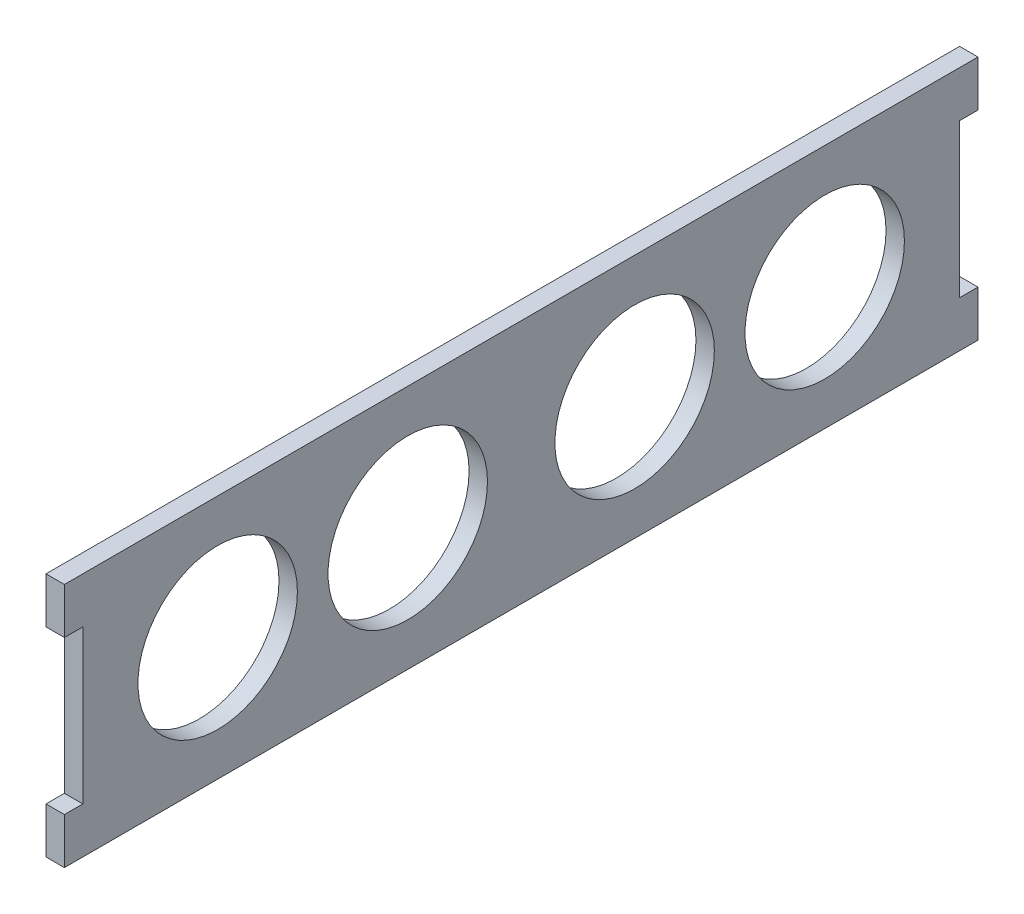
ISO-10303-21;
HEADER;
FILE_DESCRIPTION(('STEP AP214'),'2;1');
FILE_NAME('part.step','',(''),(''),'','','');
FILE_SCHEMA(('AUTOMOTIVE_DESIGN { 1 0 10303 214 1 1 1 1 }'));
ENDSEC;
DATA;
#1=APPLICATION_CONTEXT('core data for automotive mechanical design processes');
#2=APPLICATION_PROTOCOL_DEFINITION('international standard','automotive_design',2000,#1);
#3=PRODUCT_CONTEXT('',#1,'mechanical');
#4=PRODUCT('Part','Part','',(#3));
#5=PRODUCT_RELATED_PRODUCT_CATEGORY('part','',(#4));
#6=PRODUCT_DEFINITION_FORMATION('','',#4);
#7=PRODUCT_DEFINITION_CONTEXT('part definition',#1,'design');
#8=PRODUCT_DEFINITION('design','',#6,#7);
#9=PRODUCT_DEFINITION_SHAPE('','',#8);
#10=(LENGTH_UNIT() NAMED_UNIT(*) SI_UNIT(.MILLI.,.METRE.));
#11=(NAMED_UNIT(*) PLANE_ANGLE_UNIT() SI_UNIT($,.RADIAN.));
#12=(NAMED_UNIT(*) SI_UNIT($,.STERADIAN.) SOLID_ANGLE_UNIT());
#13=UNCERTAINTY_MEASURE_WITH_UNIT(LENGTH_MEASURE(1.E-05),#10,'distance_accuracy_value','');
#14=(GEOMETRIC_REPRESENTATION_CONTEXT(3) GLOBAL_UNCERTAINTY_ASSIGNED_CONTEXT((#13)) GLOBAL_UNIT_ASSIGNED_CONTEXT((#10,
#11,#12)) REPRESENTATION_CONTEXT('',''));
#15=CARTESIAN_POINT('',(0.,0.,0.));
#16=DIRECTION('',(0.,0.,1.));
#17=DIRECTION('',(1.,0.,0.));
#18=AXIS2_PLACEMENT_3D('',#15,#16,#17);
#19=CARTESIAN_POINT('',(3.,0.,71.5));
#20=DIRECTION('',(0.,0.,-1.));
#21=DIRECTION('',(-1.,0.,0.));
#22=AXIS2_PLACEMENT_3D('',#19,#20,#21);
#23=PLANE('',#22);
#24=DIRECTION('',(0.,-1.,0.));
#25=VECTOR('',#24,1.);
#26=CARTESIAN_POINT('',(0.,0.,71.5));
#27=LINE('',#26,#25);
#28=CARTESIAN_POINT('',(0.,12.5,71.5));
#29=VERTEX_POINT('',#28);
#30=CARTESIAN_POINT('',(0.,-12.5,71.5));
#31=VERTEX_POINT('',#30);
#32=EDGE_CURVE('E170',#29,#31,#27,.T.);
#33=ORIENTED_EDGE('',*,*,#32,.T.);
#34=DIRECTION('',(-1.,0.,0.));
#35=VECTOR('',#34,1.);
#36=CARTESIAN_POINT('',(3.,-12.5,71.5));
#37=LINE('',#36,#35);
#38=CARTESIAN_POINT('',(3.,-12.5,71.5));
#39=VERTEX_POINT('',#38);
#40=EDGE_CURVE('E11',#39,#31,#37,.T.);
#41=ORIENTED_EDGE('',*,*,#40,.F.);
#42=DIRECTION('',(0.,-1.,0.));
#43=VECTOR('',#42,1.);
#44=CARTESIAN_POINT('',(3.,0.,71.5));
#45=LINE('',#44,#43);
#46=CARTESIAN_POINT('',(3.,12.5,71.5));
#47=VERTEX_POINT('',#46);
#48=EDGE_CURVE('E104',#47,#39,#45,.T.);
#49=ORIENTED_EDGE('',*,*,#48,.F.);
#50=DIRECTION('',(-1.,0.,0.));
#51=VECTOR('',#50,1.);
#52=CARTESIAN_POINT('',(3.,12.5,71.5));
#53=LINE('',#52,#51);
#54=EDGE_CURVE('E157',#47,#29,#53,.T.);
#55=ORIENTED_EDGE('',*,*,#54,.T.);
#56=EDGE_LOOP('',(#33,#41,#49,#55));
#57=FACE_BOUND('',#56,.T.);
#58=ADVANCED_FACE('F36',(#57),#23,.F.);
#59=CARTESIAN_POINT('',(3.,-12.5,0.));
#60=DIRECTION('',(0.,1.,0.));
#61=DIRECTION('',(0.,0.,1.));
#62=AXIS2_PLACEMENT_3D('',#59,#60,#61);
#63=PLANE('',#62);
#64=DIRECTION('',(0.,0.,-1.));
#65=VECTOR('',#64,1.);
#66=CARTESIAN_POINT('',(0.,-12.5,0.));
#67=LINE('',#66,#65);
#68=CARTESIAN_POINT('',(0.,-12.5,74.5));
#69=VERTEX_POINT('',#68);
#70=EDGE_CURVE('E173',#69,#31,#67,.T.);
#71=ORIENTED_EDGE('',*,*,#70,.F.);
#72=DIRECTION('',(-1.,0.,0.));
#73=VECTOR('',#72,1.);
#74=CARTESIAN_POINT('',(3.,-12.5,74.5));
#75=LINE('',#74,#73);
#76=CARTESIAN_POINT('',(3.,-12.5,74.5));
#77=VERTEX_POINT('',#76);
#78=EDGE_CURVE('E45',#77,#69,#75,.T.);
#79=ORIENTED_EDGE('',*,*,#78,.F.);
#80=DIRECTION('',(0.,0.,-1.));
#81=VECTOR('',#80,1.);
#82=CARTESIAN_POINT('',(3.,-12.5,0.));
#83=LINE('',#82,#81);
#84=EDGE_CURVE('E229',#77,#39,#83,.T.);
#85=ORIENTED_EDGE('',*,*,#84,.T.);
#86=ORIENTED_EDGE('',*,*,#40,.T.);
#87=EDGE_LOOP('',(#71,#79,#85,#86));
#88=FACE_BOUND('',#87,.T.);
#89=ADVANCED_FACE('F228',(#88),#63,.T.);
#90=CARTESIAN_POINT('',(3.,0.,74.5));
#91=DIRECTION('',(0.,0.,-1.));
#92=DIRECTION('',(-1.,0.,0.));
#93=AXIS2_PLACEMENT_3D('',#90,#91,#92);
#94=PLANE('',#93);
#95=DIRECTION('',(0.,-1.,0.));
#96=VECTOR('',#95,1.);
#97=CARTESIAN_POINT('',(0.,0.,74.5));
#98=LINE('',#97,#96);
#99=CARTESIAN_POINT('',(0.,-20.,74.5));
#100=VERTEX_POINT('',#99);
#101=EDGE_CURVE('E176',#69,#100,#98,.T.);
#102=ORIENTED_EDGE('',*,*,#101,.T.);
#103=DIRECTION('',(-1.,0.,0.));
#104=VECTOR('',#103,1.);
#105=CARTESIAN_POINT('',(3.,-20.,74.5));
#106=LINE('',#105,#104);
#107=CARTESIAN_POINT('',(3.,-20.,74.5));
#108=VERTEX_POINT('',#107);
#109=EDGE_CURVE('E213',#108,#100,#106,.T.);
#110=ORIENTED_EDGE('',*,*,#109,.F.);
#111=DIRECTION('',(0.,-1.,0.));
#112=VECTOR('',#111,1.);
#113=CARTESIAN_POINT('',(3.,0.,74.5));
#114=LINE('',#113,#112);
#115=EDGE_CURVE('E220',#77,#108,#114,.T.);
#116=ORIENTED_EDGE('',*,*,#115,.F.);
#117=ORIENTED_EDGE('',*,*,#78,.T.);
#118=EDGE_LOOP('',(#102,#110,#116,#117));
#119=FACE_BOUND('',#118,.T.);
#120=ADVANCED_FACE('F218',(#119),#94,.F.);
#121=CARTESIAN_POINT('',(3.,-20.,0.));
#122=DIRECTION('',(0.,1.,0.));
#123=DIRECTION('',(0.,0.,1.));
#124=AXIS2_PLACEMENT_3D('',#121,#122,#123);
#125=PLANE('',#124);
#126=DIRECTION('',(0.,0.,-1.));
#127=VECTOR('',#126,1.);
#128=CARTESIAN_POINT('',(0.,-20.,0.));
#129=LINE('',#128,#127);
#130=CARTESIAN_POINT('',(0.,-20.,-74.5));
#131=VERTEX_POINT('',#130);
#132=EDGE_CURVE('E178',#100,#131,#129,.T.);
#133=ORIENTED_EDGE('',*,*,#132,.T.);
#134=DIRECTION('',(-1.,0.,0.));
#135=VECTOR('',#134,1.);
#136=CARTESIAN_POINT('',(3.,-20.,-74.5));
#137=LINE('',#136,#135);
#138=CARTESIAN_POINT('',(3.,-20.,-74.5));
#139=VERTEX_POINT('',#138);
#140=EDGE_CURVE('E211',#139,#131,#137,.T.);
#141=ORIENTED_EDGE('',*,*,#140,.F.);
#142=DIRECTION('',(0.,0.,-1.));
#143=VECTOR('',#142,1.);
#144=CARTESIAN_POINT('',(3.,-20.,0.));
#145=LINE('',#144,#143);
#146=EDGE_CURVE('E257',#108,#139,#145,.T.);
#147=ORIENTED_EDGE('',*,*,#146,.F.);
#148=ORIENTED_EDGE('',*,*,#109,.T.);
#149=EDGE_LOOP('',(#133,#141,#147,#148));
#150=FACE_BOUND('',#149,.T.);
#151=ADVANCED_FACE('F256',(#150),#125,.F.);
#152=CARTESIAN_POINT('',(3.,0.,-74.5));
#153=DIRECTION('',(0.,0.,-1.));
#154=DIRECTION('',(-1.,0.,0.));
#155=AXIS2_PLACEMENT_3D('',#152,#153,#154);
#156=PLANE('',#155);
#157=DIRECTION('',(0.,-1.,0.));
#158=VECTOR('',#157,1.);
#159=CARTESIAN_POINT('',(0.,0.,-74.5));
#160=LINE('',#159,#158);
#161=CARTESIAN_POINT('',(0.,-12.5,-74.5));
#162=VERTEX_POINT('',#161);
#163=EDGE_CURVE('E181',#162,#131,#160,.T.);
#164=ORIENTED_EDGE('',*,*,#163,.F.);
#165=DIRECTION('',(-1.,0.,0.));
#166=VECTOR('',#165,1.);
#167=CARTESIAN_POINT('',(3.,-12.5,-74.5));
#168=LINE('',#167,#166);
#169=CARTESIAN_POINT('',(3.,-12.5,-74.5));
#170=VERTEX_POINT('',#169);
#171=EDGE_CURVE('E209',#170,#162,#168,.T.);
#172=ORIENTED_EDGE('',*,*,#171,.F.);
#173=DIRECTION('',(0.,-1.,0.));
#174=VECTOR('',#173,1.);
#175=CARTESIAN_POINT('',(3.,0.,-74.5));
#176=LINE('',#175,#174);
#177=EDGE_CURVE('E253',#170,#139,#176,.T.);
#178=ORIENTED_EDGE('',*,*,#177,.T.);
#179=ORIENTED_EDGE('',*,*,#140,.T.);
#180=EDGE_LOOP('',(#164,#172,#178,#179));
#181=FACE_BOUND('',#180,.T.);
#182=ADVANCED_FACE('F248',(#181),#156,.T.);
#183=CARTESIAN_POINT('',(3.,-12.5,0.));
#184=DIRECTION('',(0.,-1.,0.));
#185=DIRECTION('',(0.,0.,-1.));
#186=AXIS2_PLACEMENT_3D('',#183,#184,#185);
#187=PLANE('',#186);
#188=DIRECTION('',(0.,0.,1.));
#189=VECTOR('',#188,1.);
#190=CARTESIAN_POINT('',(0.,-12.5,0.));
#191=LINE('',#190,#189);
#192=CARTESIAN_POINT('',(0.,-12.5,-71.5));
#193=VERTEX_POINT('',#192);
#194=EDGE_CURVE('E184',#162,#193,#191,.T.);
#195=ORIENTED_EDGE('',*,*,#194,.T.);
#196=DIRECTION('',(-1.,0.,0.));
#197=VECTOR('',#196,1.);
#198=CARTESIAN_POINT('',(3.,-12.5,-71.5));
#199=LINE('',#198,#197);
#200=CARTESIAN_POINT('',(3.,-12.5,-71.5));
#201=VERTEX_POINT('',#200);
#202=EDGE_CURVE('E207',#201,#193,#199,.T.);
#203=ORIENTED_EDGE('',*,*,#202,.F.);
#204=DIRECTION('',(0.,0.,1.));
#205=VECTOR('',#204,1.);
#206=CARTESIAN_POINT('',(3.,-12.5,0.));
#207=LINE('',#206,#205);
#208=EDGE_CURVE('E259',#170,#201,#207,.T.);
#209=ORIENTED_EDGE('',*,*,#208,.F.);
#210=ORIENTED_EDGE('',*,*,#171,.T.);
#211=EDGE_LOOP('',(#195,#203,#209,#210));
#212=FACE_BOUND('',#211,.T.);
#213=ADVANCED_FACE('F266',(#212),#187,.F.);
#214=CARTESIAN_POINT('',(3.,0.,-71.5));
#215=DIRECTION('',(0.,0.,-1.));
#216=DIRECTION('',(-1.,0.,0.));
#217=AXIS2_PLACEMENT_3D('',#214,#215,#216);
#218=PLANE('',#217);
#219=DIRECTION('',(0.,-1.,0.));
#220=VECTOR('',#219,1.);
#221=CARTESIAN_POINT('',(0.,0.,-71.5));
#222=LINE('',#221,#220);
#223=CARTESIAN_POINT('',(0.,12.5,-71.5));
#224=VERTEX_POINT('',#223);
#225=EDGE_CURVE('E187',#224,#193,#222,.T.);
#226=ORIENTED_EDGE('',*,*,#225,.F.);
#227=DIRECTION('',(-1.,0.,0.));
#228=VECTOR('',#227,1.);
#229=CARTESIAN_POINT('',(3.,12.5,-71.5));
#230=LINE('',#229,#228);
#231=CARTESIAN_POINT('',(3.,12.5,-71.5));
#232=VERTEX_POINT('',#231);
#233=EDGE_CURVE('E205',#232,#224,#230,.T.);
#234=ORIENTED_EDGE('',*,*,#233,.F.);
#235=DIRECTION('',(0.,-1.,0.));
#236=VECTOR('',#235,1.);
#237=CARTESIAN_POINT('',(3.,0.,-71.5));
#238=LINE('',#237,#236);
#239=EDGE_CURVE('E265',#232,#201,#238,.T.);
#240=ORIENTED_EDGE('',*,*,#239,.T.);
#241=ORIENTED_EDGE('',*,*,#202,.T.);
#242=EDGE_LOOP('',(#226,#234,#240,#241));
#243=FACE_BOUND('',#242,.T.);
#244=ADVANCED_FACE('F242',(#243),#218,.T.);
#245=CARTESIAN_POINT('',(3.,12.5,0.));
#246=DIRECTION('',(0.,-1.,0.));
#247=DIRECTION('',(0.,0.,-1.));
#248=AXIS2_PLACEMENT_3D('',#245,#246,#247);
#249=PLANE('',#248);
#250=DIRECTION('',(0.,0.,1.));
#251=VECTOR('',#250,1.);
#252=CARTESIAN_POINT('',(0.,12.5,0.));
#253=LINE('',#252,#251);
#254=CARTESIAN_POINT('',(0.,12.5,-74.5));
#255=VERTEX_POINT('',#254);
#256=EDGE_CURVE('E190',#255,#224,#253,.T.);
#257=ORIENTED_EDGE('',*,*,#256,.F.);
#258=DIRECTION('',(-1.,0.,0.));
#259=VECTOR('',#258,1.);
#260=CARTESIAN_POINT('',(3.,12.5,-74.5));
#261=LINE('',#260,#259);
#262=CARTESIAN_POINT('',(3.,12.5,-74.5));
#263=VERTEX_POINT('',#262);
#264=EDGE_CURVE('E203',#263,#255,#261,.T.);
#265=ORIENTED_EDGE('',*,*,#264,.F.);
#266=DIRECTION('',(0.,0.,1.));
#267=VECTOR('',#266,1.);
#268=CARTESIAN_POINT('',(3.,12.5,0.));
#269=LINE('',#268,#267);
#270=EDGE_CURVE('E152',#263,#232,#269,.T.);
#271=ORIENTED_EDGE('',*,*,#270,.T.);
#272=ORIENTED_EDGE('',*,*,#233,.T.);
#273=EDGE_LOOP('',(#257,#265,#271,#272));
#274=FACE_BOUND('',#273,.T.);
#275=ADVANCED_FACE('F237',(#274),#249,.T.);
#276=CARTESIAN_POINT('',(3.,0.,-74.5));
#277=DIRECTION('',(0.,0.,-1.));
#278=DIRECTION('',(-1.,0.,0.));
#279=AXIS2_PLACEMENT_3D('',#276,#277,#278);
#280=PLANE('',#279);
#281=DIRECTION('',(0.,-1.,0.));
#282=VECTOR('',#281,1.);
#283=CARTESIAN_POINT('',(0.,0.,-74.5));
#284=LINE('',#283,#282);
#285=CARTESIAN_POINT('',(0.,20.,-74.5));
#286=VERTEX_POINT('',#285);
#287=EDGE_CURVE('E193',#286,#255,#284,.T.);
#288=ORIENTED_EDGE('',*,*,#287,.F.);
#289=DIRECTION('',(-1.,0.,0.));
#290=VECTOR('',#289,1.);
#291=CARTESIAN_POINT('',(3.,20.,-74.5));
#292=LINE('',#291,#290);
#293=CARTESIAN_POINT('',(3.,20.,-74.5));
#294=VERTEX_POINT('',#293);
#295=EDGE_CURVE('E140',#294,#286,#292,.T.);
#296=ORIENTED_EDGE('',*,*,#295,.F.);
#297=DIRECTION('',(0.,-1.,0.));
#298=VECTOR('',#297,1.);
#299=CARTESIAN_POINT('',(3.,0.,-74.5));
#300=LINE('',#299,#298);
#301=EDGE_CURVE('E150',#294,#263,#300,.T.);
#302=ORIENTED_EDGE('',*,*,#301,.T.);
#303=ORIENTED_EDGE('',*,*,#264,.T.);
#304=EDGE_LOOP('',(#288,#296,#302,#303));
#305=FACE_BOUND('',#304,.T.);
#306=ADVANCED_FACE('F234',(#305),#280,.T.);
#307=CARTESIAN_POINT('',(3.,20.,0.));
#308=DIRECTION('',(0.,1.,0.));
#309=DIRECTION('',(0.,0.,1.));
#310=AXIS2_PLACEMENT_3D('',#307,#308,#309);
#311=PLANE('',#310);
#312=DIRECTION('',(0.,0.,-1.));
#313=VECTOR('',#312,1.);
#314=CARTESIAN_POINT('',(0.,20.,0.));
#315=LINE('',#314,#313);
#316=CARTESIAN_POINT('',(0.,20.,74.5));
#317=VERTEX_POINT('',#316);
#318=EDGE_CURVE('E139',#317,#286,#315,.T.);
#319=ORIENTED_EDGE('',*,*,#318,.F.);
#320=DIRECTION('',(-1.,0.,0.));
#321=VECTOR('',#320,1.);
#322=CARTESIAN_POINT('',(3.,20.,74.5));
#323=LINE('',#322,#321);
#324=CARTESIAN_POINT('',(3.,20.,74.5));
#325=VERTEX_POINT('',#324);
#326=EDGE_CURVE('E133',#325,#317,#323,.T.);
#327=ORIENTED_EDGE('',*,*,#326,.F.);
#328=DIRECTION('',(0.,0.,-1.));
#329=VECTOR('',#328,1.);
#330=CARTESIAN_POINT('',(3.,20.,0.));
#331=LINE('',#330,#329);
#332=EDGE_CURVE('E137',#325,#294,#331,.T.);
#333=ORIENTED_EDGE('',*,*,#332,.T.);
#334=ORIENTED_EDGE('',*,*,#295,.T.);
#335=EDGE_LOOP('',(#319,#327,#333,#334));
#336=FACE_BOUND('',#335,.T.);
#337=ADVANCED_FACE('F135',(#336),#311,.T.);
#338=CARTESIAN_POINT('',(3.,0.,74.5));
#339=DIRECTION('',(0.,0.,-1.));
#340=DIRECTION('',(-1.,0.,0.));
#341=AXIS2_PLACEMENT_3D('',#338,#339,#340);
#342=PLANE('',#341);
#343=DIRECTION('',(0.,-1.,0.));
#344=VECTOR('',#343,1.);
#345=CARTESIAN_POINT('',(0.,0.,74.5));
#346=LINE('',#345,#344);
#347=CARTESIAN_POINT('',(0.,12.5,74.5));
#348=VERTEX_POINT('',#347);
#349=EDGE_CURVE('E92',#317,#348,#346,.T.);
#350=ORIENTED_EDGE('',*,*,#349,.T.);
#351=DIRECTION('',(-1.,0.,0.));
#352=VECTOR('',#351,1.);
#353=CARTESIAN_POINT('',(3.,12.5,74.5));
#354=LINE('',#353,#352);
#355=CARTESIAN_POINT('',(3.,12.5,74.5));
#356=VERTEX_POINT('',#355);
#357=EDGE_CURVE('E141',#356,#348,#354,.T.);
#358=ORIENTED_EDGE('',*,*,#357,.F.);
#359=DIRECTION('',(0.,-1.,0.));
#360=VECTOR('',#359,1.);
#361=CARTESIAN_POINT('',(3.,0.,74.5));
#362=LINE('',#361,#360);
#363=EDGE_CURVE('E143',#325,#356,#362,.T.);
#364=ORIENTED_EDGE('',*,*,#363,.F.);
#365=ORIENTED_EDGE('',*,*,#326,.T.);
#366=EDGE_LOOP('',(#350,#358,#364,#365));
#367=FACE_BOUND('',#366,.T.);
#368=ADVANCED_FACE('F144',(#367),#342,.F.);
#369=CARTESIAN_POINT('',(3.,0.,-49.5));
#370=DIRECTION('',(-1.,0.,0.));
#371=DIRECTION('',(0.,0.,1.));
#372=AXIS2_PLACEMENT_3D('',#369,#370,#371);
#373=CYLINDRICAL_SURFACE('',#372,13.);
#374=CARTESIAN_POINT('',(3.,0.,-49.5));
#375=DIRECTION('',(1.,0.,0.));
#376=DIRECTION('',(0.,0.,-1.));
#377=AXIS2_PLACEMENT_3D('',#374,#375,#376);
#378=CIRCLE('',#377,13.);
#379=CARTESIAN_POINT('',(3.,0.,-62.5));
#380=VERTEX_POINT('',#379);
#381=EDGE_CURVE('E449',#380,#380,#378,.T.);
#382=ORIENTED_EDGE('',*,*,#381,.T.);
#383=EDGE_LOOP('',(#382));
#384=FACE_BOUND('',#383,.T.);
#385=CARTESIAN_POINT('',(0.,0.,-49.5));
#386=DIRECTION('',(1.,0.,0.));
#387=DIRECTION('',(0.,0.,-1.));
#388=AXIS2_PLACEMENT_3D('',#385,#386,#387);
#389=CIRCLE('',#388,13.);
#390=CARTESIAN_POINT('',(0.,0.,-62.5));
#391=VERTEX_POINT('',#390);
#392=EDGE_CURVE('E167',#391,#391,#389,.T.);
#393=ORIENTED_EDGE('',*,*,#392,.F.);
#394=EDGE_LOOP('',(#393));
#395=FACE_BOUND('',#394,.T.);
#396=ADVANCED_FACE('F283',(#384,#395),#373,.F.);
#397=CARTESIAN_POINT('',(3.,0.,-18.5));
#398=DIRECTION('',(-1.,0.,0.));
#399=DIRECTION('',(0.,0.,1.));
#400=AXIS2_PLACEMENT_3D('',#397,#398,#399);
#401=CYLINDRICAL_SURFACE('',#400,13.);
#402=CARTESIAN_POINT('',(3.,0.,-18.5));
#403=DIRECTION('',(1.,0.,0.));
#404=DIRECTION('',(0.,0.,-1.));
#405=AXIS2_PLACEMENT_3D('',#402,#403,#404);
#406=CIRCLE('',#405,13.);
#407=CARTESIAN_POINT('',(3.,0.,-31.5));
#408=VERTEX_POINT('',#407);
#409=EDGE_CURVE('E446',#408,#408,#406,.T.);
#410=ORIENTED_EDGE('',*,*,#409,.T.);
#411=EDGE_LOOP('',(#410));
#412=FACE_BOUND('',#411,.T.);
#413=CARTESIAN_POINT('',(0.,0.,-18.5));
#414=DIRECTION('',(1.,0.,0.));
#415=DIRECTION('',(0.,0.,-1.));
#416=AXIS2_PLACEMENT_3D('',#413,#414,#415);
#417=CIRCLE('',#416,13.);
#418=CARTESIAN_POINT('',(0.,0.,-31.5));
#419=VERTEX_POINT('',#418);
#420=EDGE_CURVE('E164',#419,#419,#417,.T.);
#421=ORIENTED_EDGE('',*,*,#420,.F.);
#422=EDGE_LOOP('',(#421));
#423=FACE_BOUND('',#422,.T.);
#424=ADVANCED_FACE('F286',(#412,#423),#401,.F.);
#425=CARTESIAN_POINT('',(3.,0.,18.5));
#426=DIRECTION('',(-1.,0.,0.));
#427=DIRECTION('',(0.,0.,1.));
#428=AXIS2_PLACEMENT_3D('',#425,#426,#427);
#429=CYLINDRICAL_SURFACE('',#428,13.);
#430=CARTESIAN_POINT('',(3.,0.,18.5));
#431=DIRECTION('',(1.,0.,0.));
#432=DIRECTION('',(0.,0.,-1.));
#433=AXIS2_PLACEMENT_3D('',#430,#431,#432);
#434=CIRCLE('',#433,13.);
#435=CARTESIAN_POINT('',(3.,0.,5.49999999999998));
#436=VERTEX_POINT('',#435);
#437=EDGE_CURVE('E301',#436,#436,#434,.T.);
#438=ORIENTED_EDGE('',*,*,#437,.T.);
#439=EDGE_LOOP('',(#438));
#440=FACE_BOUND('',#439,.T.);
#441=CARTESIAN_POINT('',(0.,0.,18.5));
#442=DIRECTION('',(1.,0.,0.));
#443=DIRECTION('',(0.,0.,-1.));
#444=AXIS2_PLACEMENT_3D('',#441,#442,#443);
#445=CIRCLE('',#444,13.);
#446=CARTESIAN_POINT('',(0.,0.,5.49999999999998));
#447=VERTEX_POINT('',#446);
#448=EDGE_CURVE('E161',#447,#447,#445,.T.);
#449=ORIENTED_EDGE('',*,*,#448,.F.);
#450=EDGE_LOOP('',(#449));
#451=FACE_BOUND('',#450,.T.);
#452=ADVANCED_FACE('F289',(#440,#451),#429,.F.);
#453=CARTESIAN_POINT('',(3.,0.,49.5));
#454=DIRECTION('',(-1.,0.,0.));
#455=DIRECTION('',(0.,0.,1.));
#456=AXIS2_PLACEMENT_3D('',#453,#454,#455);
#457=CYLINDRICAL_SURFACE('',#456,13.);
#458=CARTESIAN_POINT('',(3.,0.,49.5));
#459=DIRECTION('',(1.,0.,0.));
#460=DIRECTION('',(0.,0.,-1.));
#461=AXIS2_PLACEMENT_3D('',#458,#459,#460);
#462=CIRCLE('',#461,13.);
#463=CARTESIAN_POINT('',(3.,0.,36.5));
#464=VERTEX_POINT('',#463);
#465=EDGE_CURVE('E199',#464,#464,#462,.T.);
#466=ORIENTED_EDGE('',*,*,#465,.T.);
#467=EDGE_LOOP('',(#466));
#468=FACE_BOUND('',#467,.T.);
#469=CARTESIAN_POINT('',(0.,0.,49.5));
#470=DIRECTION('',(1.,0.,0.));
#471=DIRECTION('',(0.,0.,-1.));
#472=AXIS2_PLACEMENT_3D('',#469,#470,#471);
#473=CIRCLE('',#472,13.);
#474=CARTESIAN_POINT('',(0.,0.,36.5));
#475=VERTEX_POINT('',#474);
#476=EDGE_CURVE('E158',#475,#475,#473,.T.);
#477=ORIENTED_EDGE('',*,*,#476,.F.);
#478=EDGE_LOOP('',(#477));
#479=FACE_BOUND('',#478,.T.);
#480=ADVANCED_FACE('F38',(#468,#479),#457,.F.);
#481=CARTESIAN_POINT('',(3.,12.5,0.));
#482=DIRECTION('',(0.,1.,0.));
#483=DIRECTION('',(0.,0.,1.));
#484=AXIS2_PLACEMENT_3D('',#481,#482,#483);
#485=PLANE('',#484);
#486=DIRECTION('',(0.,0.,-1.));
#487=VECTOR('',#486,1.);
#488=CARTESIAN_POINT('',(0.,12.5,0.));
#489=LINE('',#488,#487);
#490=EDGE_CURVE('E98',#348,#29,#489,.T.);
#491=ORIENTED_EDGE('',*,*,#490,.T.);
#492=ORIENTED_EDGE('',*,*,#54,.F.);
#493=DIRECTION('',(0.,0.,-1.));
#494=VECTOR('',#493,1.);
#495=CARTESIAN_POINT('',(3.,12.5,0.));
#496=LINE('',#495,#494);
#497=EDGE_CURVE('E53',#356,#47,#496,.T.);
#498=ORIENTED_EDGE('',*,*,#497,.F.);
#499=ORIENTED_EDGE('',*,*,#357,.T.);
#500=EDGE_LOOP('',(#491,#492,#498,#499));
#501=FACE_BOUND('',#500,.T.);
#502=ADVANCED_FACE('F296',(#501),#485,.F.);
#503=CARTESIAN_POINT('',(3.,0.,0.));
#504=DIRECTION('',(1.,0.,0.));
#505=DIRECTION('',(0.,0.,-1.));
#506=AXIS2_PLACEMENT_3D('',#503,#504,#505);
#507=PLANE('',#506);
#508=ORIENTED_EDGE('',*,*,#465,.F.);
#509=EDGE_LOOP('',(#508));
#510=FACE_BOUND('',#509,.T.);
#511=ORIENTED_EDGE('',*,*,#437,.F.);
#512=EDGE_LOOP('',(#511));
#513=FACE_BOUND('',#512,.T.);
#514=ORIENTED_EDGE('',*,*,#409,.F.);
#515=EDGE_LOOP('',(#514));
#516=FACE_BOUND('',#515,.T.);
#517=ORIENTED_EDGE('',*,*,#381,.F.);
#518=EDGE_LOOP('',(#517));
#519=FACE_BOUND('',#518,.T.);
#520=ORIENTED_EDGE('',*,*,#48,.T.);
#521=ORIENTED_EDGE('',*,*,#84,.F.);
#522=ORIENTED_EDGE('',*,*,#115,.T.);
#523=ORIENTED_EDGE('',*,*,#146,.T.);
#524=ORIENTED_EDGE('',*,*,#177,.F.);
#525=ORIENTED_EDGE('',*,*,#208,.T.);
#526=ORIENTED_EDGE('',*,*,#239,.F.);
#527=ORIENTED_EDGE('',*,*,#270,.F.);
#528=ORIENTED_EDGE('',*,*,#301,.F.);
#529=ORIENTED_EDGE('',*,*,#332,.F.);
#530=ORIENTED_EDGE('',*,*,#363,.T.);
#531=ORIENTED_EDGE('',*,*,#497,.T.);
#532=EDGE_LOOP('',(#520,#521,#522,#523,#524,#525,#526,#527,#528,#529,#530,#531));
#533=FACE_BOUND('',#532,.T.);
#534=ADVANCED_FACE('F147',(#510,#513,#516,#519,#533),#507,.T.);
#535=CARTESIAN_POINT('',(0.,0.,0.));
#536=DIRECTION('',(1.,0.,0.));
#537=DIRECTION('',(0.,0.,-1.));
#538=AXIS2_PLACEMENT_3D('',#535,#536,#537);
#539=PLANE('',#538);
#540=ORIENTED_EDGE('',*,*,#476,.T.);
#541=EDGE_LOOP('',(#540));
#542=FACE_BOUND('',#541,.T.);
#543=ORIENTED_EDGE('',*,*,#448,.T.);
#544=EDGE_LOOP('',(#543));
#545=FACE_BOUND('',#544,.T.);
#546=ORIENTED_EDGE('',*,*,#420,.T.);
#547=EDGE_LOOP('',(#546));
#548=FACE_BOUND('',#547,.T.);
#549=ORIENTED_EDGE('',*,*,#392,.T.);
#550=EDGE_LOOP('',(#549));
#551=FACE_BOUND('',#550,.T.);
#552=ORIENTED_EDGE('',*,*,#32,.F.);
#553=ORIENTED_EDGE('',*,*,#490,.F.);
#554=ORIENTED_EDGE('',*,*,#349,.F.);
#555=ORIENTED_EDGE('',*,*,#318,.T.);
#556=ORIENTED_EDGE('',*,*,#287,.T.);
#557=ORIENTED_EDGE('',*,*,#256,.T.);
#558=ORIENTED_EDGE('',*,*,#225,.T.);
#559=ORIENTED_EDGE('',*,*,#194,.F.);
#560=ORIENTED_EDGE('',*,*,#163,.T.);
#561=ORIENTED_EDGE('',*,*,#132,.F.);
#562=ORIENTED_EDGE('',*,*,#101,.F.);
#563=ORIENTED_EDGE('',*,*,#70,.T.);
#564=EDGE_LOOP('',(#552,#553,#554,#555,#556,#557,#558,#559,#560,#561,#562,#563));
#565=FACE_BOUND('',#564,.T.);
#566=ADVANCED_FACE('F227',(#542,#545,#548,#551,#565),#539,.F.);
#567=CLOSED_SHELL('',(#58,#89,#120,#151,#182,#213,#244,#275,#306,#337,#368,#396,#424,#452,#480,
#502,#534,#566));
#568=MANIFOLD_SOLID_BREP('B2',#567);
#569=ADVANCED_BREP_SHAPE_REPRESENTATION('',(#18,#568),#14);
#570=SHAPE_DEFINITION_REPRESENTATION(#9,#569);
ENDSEC;
END-ISO-10303-21;
